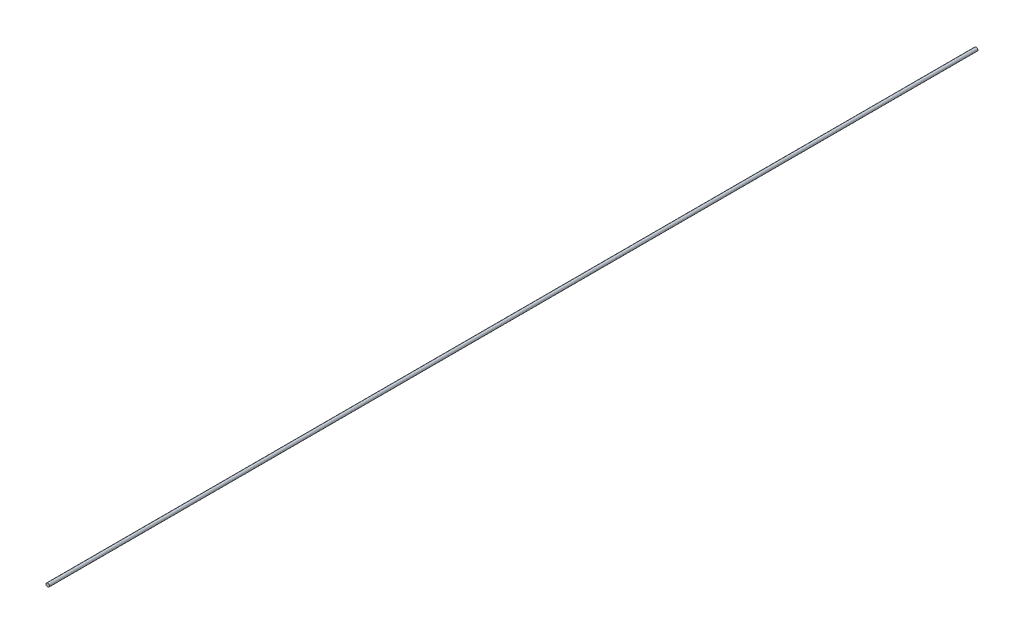
ISO-10303-21;
HEADER;
FILE_DESCRIPTION(('STEP AP214'),'2;1');
FILE_NAME('part.step','',(''),(''),'','','');
FILE_SCHEMA(('AUTOMOTIVE_DESIGN { 1 0 10303 214 1 1 1 1 }'));
ENDSEC;
DATA;
#1=APPLICATION_CONTEXT('core data for automotive mechanical design processes');
#2=APPLICATION_PROTOCOL_DEFINITION('international standard','automotive_design',2000,#1);
#3=PRODUCT_CONTEXT('',#1,'mechanical');
#4=PRODUCT('Part','Part','',(#3));
#5=PRODUCT_RELATED_PRODUCT_CATEGORY('part','',(#4));
#6=PRODUCT_DEFINITION_FORMATION('','',#4);
#7=PRODUCT_DEFINITION_CONTEXT('part definition',#1,'design');
#8=PRODUCT_DEFINITION('design','',#6,#7);
#9=PRODUCT_DEFINITION_SHAPE('','',#8);
#10=(LENGTH_UNIT() NAMED_UNIT(*) SI_UNIT(.MILLI.,.METRE.));
#11=(NAMED_UNIT(*) PLANE_ANGLE_UNIT() SI_UNIT($,.RADIAN.));
#12=(NAMED_UNIT(*) SI_UNIT($,.STERADIAN.) SOLID_ANGLE_UNIT());
#13=UNCERTAINTY_MEASURE_WITH_UNIT(LENGTH_MEASURE(1.E-05),#10,'distance_accuracy_value','');
#14=(GEOMETRIC_REPRESENTATION_CONTEXT(3) GLOBAL_UNCERTAINTY_ASSIGNED_CONTEXT((#13)) GLOBAL_UNIT_ASSIGNED_CONTEXT((#10,
#11,#12)) REPRESENTATION_CONTEXT('',''));
#15=CARTESIAN_POINT('',(0.,0.,0.));
#16=DIRECTION('',(0.,0.,1.));
#17=DIRECTION('',(1.,0.,0.));
#18=AXIS2_PLACEMENT_3D('',#15,#16,#17);
#19=CARTESIAN_POINT('',(0.,0.,2072.));
#20=DIRECTION('',(0.,0.,-1.));
#21=DIRECTION('',(-1.,0.,0.));
#22=AXIS2_PLACEMENT_3D('',#19,#20,#21);
#23=CYLINDRICAL_SURFACE('',#22,3.8);
#24=CARTESIAN_POINT('',(0.,0.,2072.));
#25=DIRECTION('',(0.,0.,1.));
#26=DIRECTION('',(1.,0.,0.));
#27=AXIS2_PLACEMENT_3D('',#24,#25,#26);
#28=CIRCLE('',#27,3.8);
#29=CARTESIAN_POINT('',(3.8,0.,2072.));
#30=VERTEX_POINT('',#29);
#31=EDGE_CURVE('E10',#30,#30,#28,.T.);
#32=ORIENTED_EDGE('',*,*,#31,.F.);
#33=EDGE_LOOP('',(#32));
#34=FACE_BOUND('',#33,.T.);
#35=CARTESIAN_POINT('',(0.,0.,0.));
#36=DIRECTION('',(0.,0.,1.));
#37=DIRECTION('',(1.,0.,0.));
#38=AXIS2_PLACEMENT_3D('',#35,#36,#37);
#39=CIRCLE('',#38,3.8);
#40=CARTESIAN_POINT('',(3.8,0.,0.));
#41=VERTEX_POINT('',#40);
#42=EDGE_CURVE('E37',#41,#41,#39,.T.);
#43=ORIENTED_EDGE('',*,*,#42,.T.);
#44=EDGE_LOOP('',(#43));
#45=FACE_BOUND('',#44,.T.);
#46=ADVANCED_FACE('F34',(#34,#45),#23,.T.);
#47=CARTESIAN_POINT('',(0.,0.,2072.));
#48=DIRECTION('',(0.,0.,1.));
#49=DIRECTION('',(1.,0.,0.));
#50=AXIS2_PLACEMENT_3D('',#47,#48,#49);
#51=PLANE('',#50);
#52=ORIENTED_EDGE('',*,*,#31,.T.);
#53=EDGE_LOOP('',(#52));
#54=FACE_BOUND('',#53,.T.);
#55=ADVANCED_FACE('F49',(#54),#51,.T.);
#56=CARTESIAN_POINT('',(0.,0.,0.));
#57=DIRECTION('',(0.,0.,1.));
#58=DIRECTION('',(1.,0.,0.));
#59=AXIS2_PLACEMENT_3D('',#56,#57,#58);
#60=PLANE('',#59);
#61=ORIENTED_EDGE('',*,*,#42,.F.);
#62=EDGE_LOOP('',(#61));
#63=FACE_BOUND('',#62,.T.);
#64=ADVANCED_FACE('F47',(#63),#60,.F.);
#65=CLOSED_SHELL('',(#46,#55,#64));
#66=MANIFOLD_SOLID_BREP('B2',#65);
#67=ADVANCED_BREP_SHAPE_REPRESENTATION('',(#18,#66),#14);
#68=SHAPE_DEFINITION_REPRESENTATION(#9,#67);
ENDSEC;
END-ISO-10303-21;
